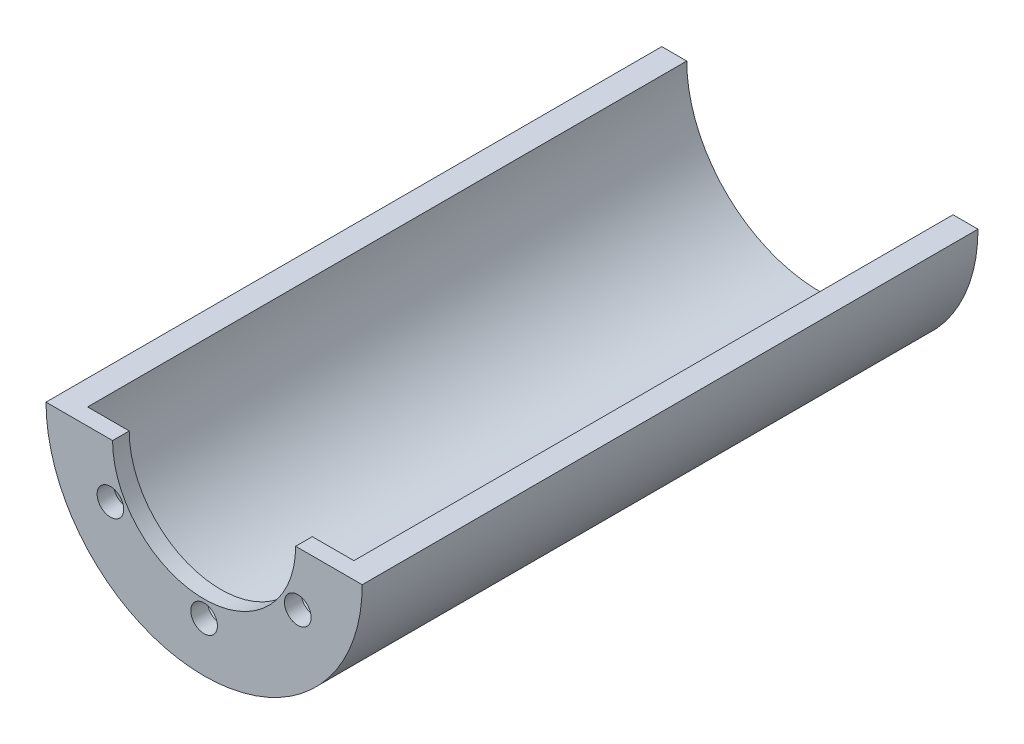
ISO-10303-21;
HEADER;
FILE_DESCRIPTION(('STEP AP214'),'2;1');
FILE_NAME('part.step','',(''),(''),'','','');
FILE_SCHEMA(('AUTOMOTIVE_DESIGN { 1 0 10303 214 1 1 1 1 }'));
ENDSEC;
DATA;
#1=APPLICATION_CONTEXT('core data for automotive mechanical design processes');
#2=APPLICATION_PROTOCOL_DEFINITION('international standard','automotive_design',2000,#1);
#3=PRODUCT_CONTEXT('',#1,'mechanical');
#4=PRODUCT('Part','Part','',(#3));
#5=PRODUCT_RELATED_PRODUCT_CATEGORY('part','',(#4));
#6=PRODUCT_DEFINITION_FORMATION('','',#4);
#7=PRODUCT_DEFINITION_CONTEXT('part definition',#1,'design');
#8=PRODUCT_DEFINITION('design','',#6,#7);
#9=PRODUCT_DEFINITION_SHAPE('','',#8);
#10=(LENGTH_UNIT() NAMED_UNIT(*) SI_UNIT(.MILLI.,.METRE.));
#11=(NAMED_UNIT(*) PLANE_ANGLE_UNIT() SI_UNIT($,.RADIAN.));
#12=(NAMED_UNIT(*) SI_UNIT($,.STERADIAN.) SOLID_ANGLE_UNIT());
#13=UNCERTAINTY_MEASURE_WITH_UNIT(LENGTH_MEASURE(1.E-05),#10,'distance_accuracy_value','');
#14=(GEOMETRIC_REPRESENTATION_CONTEXT(3) GLOBAL_UNCERTAINTY_ASSIGNED_CONTEXT((#13)) GLOBAL_UNIT_ASSIGNED_CONTEXT((#10,
#11,#12)) REPRESENTATION_CONTEXT('',''));
#15=CARTESIAN_POINT('',(0.,0.,0.));
#16=DIRECTION('',(0.,0.,1.));
#17=DIRECTION('',(1.,0.,0.));
#18=AXIS2_PLACEMENT_3D('',#15,#16,#17);
#19=CARTESIAN_POINT('',(-9.5,0.,0.));
#20=DIRECTION('',(0.,-1.,0.));
#21=DIRECTION('',(0.,0.,-1.));
#22=AXIS2_PLACEMENT_3D('',#19,#20,#21);
#23=PLANE('',#22);
#24=DIRECTION('',(-1.,0.,0.));
#25=VECTOR('',#24,1.);
#26=CARTESIAN_POINT('',(0.,0.,36.));
#27=LINE('',#26,#25);
#28=CARTESIAN_POINT('',(8.,0.,36.));
#29=VERTEX_POINT('',#28);
#30=CARTESIAN_POINT('',(5.5,0.,36.));
#31=VERTEX_POINT('',#30);
#32=EDGE_CURVE('E104',#29,#31,#27,.T.);
#33=ORIENTED_EDGE('',*,*,#32,.T.);
#34=DIRECTION('',(0.,0.,1.));
#35=VECTOR('',#34,1.);
#36=CARTESIAN_POINT('',(5.5,0.,0.));
#37=LINE('',#36,#35);
#38=CARTESIAN_POINT('',(5.5,0.,37.));
#39=VERTEX_POINT('',#38);
#40=EDGE_CURVE('E95',#31,#39,#37,.T.);
#41=ORIENTED_EDGE('',*,*,#40,.T.);
#42=DIRECTION('',(-1.,0.,0.));
#43=VECTOR('',#42,1.);
#44=CARTESIAN_POINT('',(0.,0.,37.));
#45=LINE('',#44,#43);
#46=CARTESIAN_POINT('',(9.5,0.,37.));
#47=VERTEX_POINT('',#46);
#48=EDGE_CURVE('E102',#47,#39,#45,.T.);
#49=ORIENTED_EDGE('',*,*,#48,.F.);
#50=DIRECTION('',(0.,0.,1.));
#51=VECTOR('',#50,1.);
#52=CARTESIAN_POINT('',(9.5,0.,0.));
#53=LINE('',#52,#51);
#54=CARTESIAN_POINT('',(9.5,0.,0.));
#55=VERTEX_POINT('',#54);
#56=EDGE_CURVE('E119',#55,#47,#53,.T.);
#57=ORIENTED_EDGE('',*,*,#56,.F.);
#58=DIRECTION('',(1.,0.,0.));
#59=VECTOR('',#58,1.);
#60=CARTESIAN_POINT('',(-9.5,0.,0.));
#61=LINE('',#60,#59);
#62=CARTESIAN_POINT('',(8.,0.,0.));
#63=VERTEX_POINT('',#62);
#64=EDGE_CURVE('E65',#63,#55,#61,.T.);
#65=ORIENTED_EDGE('',*,*,#64,.F.);
#66=DIRECTION('',(0.,0.,1.));
#67=VECTOR('',#66,1.);
#68=CARTESIAN_POINT('',(8.,0.,0.));
#69=LINE('',#68,#67);
#70=EDGE_CURVE('E51',#29,#63,#69,.F.);
#71=ORIENTED_EDGE('',*,*,#70,.F.);
#72=EDGE_LOOP('',(#33,#41,#49,#57,#65,#71));
#73=FACE_BOUND('',#72,.T.);
#74=ADVANCED_FACE('F43',(#73),#23,.F.);
#75=CARTESIAN_POINT('',(0.,0.,36.));
#76=DIRECTION('',(0.,0.,-1.));
#77=DIRECTION('',(-1.,0.,0.));
#78=AXIS2_PLACEMENT_3D('',#75,#76,#77);
#79=CYLINDRICAL_SURFACE('',#78,9.5);
#80=CARTESIAN_POINT('',(0.,0.,0.));
#81=DIRECTION('',(0.,0.,1.));
#82=DIRECTION('',(1.,0.,0.));
#83=AXIS2_PLACEMENT_3D('',#80,#81,#82);
#84=CIRCLE('',#83,9.5);
#85=CARTESIAN_POINT('',(-9.5,0.,0.));
#86=VERTEX_POINT('',#85);
#87=EDGE_CURVE('E127',#86,#55,#84,.T.);
#88=ORIENTED_EDGE('',*,*,#87,.T.);
#89=ORIENTED_EDGE('',*,*,#56,.T.);
#90=CARTESIAN_POINT('',(0.,0.,37.));
#91=DIRECTION('',(0.,0.,1.));
#92=DIRECTION('',(1.,0.,0.));
#93=AXIS2_PLACEMENT_3D('',#90,#91,#92);
#94=CIRCLE('',#93,9.5);
#95=CARTESIAN_POINT('',(-9.5,0.,37.));
#96=VERTEX_POINT('',#95);
#97=EDGE_CURVE('E109',#96,#47,#94,.T.);
#98=ORIENTED_EDGE('',*,*,#97,.F.);
#99=DIRECTION('',(0.,0.,1.));
#100=VECTOR('',#99,1.);
#101=CARTESIAN_POINT('',(-9.5,0.,0.));
#102=LINE('',#101,#100);
#103=EDGE_CURVE('E118',#86,#96,#102,.T.);
#104=ORIENTED_EDGE('',*,*,#103,.F.);
#105=EDGE_LOOP('',(#88,#89,#98,#104));
#106=FACE_BOUND('',#105,.T.);
#107=ADVANCED_FACE('F45',(#106),#79,.T.);
#108=CARTESIAN_POINT('',(0.,0.,0.));
#109=DIRECTION('',(0.,0.,1.));
#110=DIRECTION('',(1.,0.,0.));
#111=AXIS2_PLACEMENT_3D('',#108,#109,#110);
#112=PLANE('',#111);
#113=ORIENTED_EDGE('',*,*,#87,.F.);
#114=CARTESIAN_POINT('',(-8.,0.,0.));
#115=VERTEX_POINT('',#114);
#116=EDGE_CURVE('E112',#86,#115,#61,.T.);
#117=ORIENTED_EDGE('',*,*,#116,.T.);
#118=CARTESIAN_POINT('',(0.,0.,0.));
#119=DIRECTION('',(0.,0.,1.));
#120=DIRECTION('',(1.,0.,0.));
#121=AXIS2_PLACEMENT_3D('',#118,#119,#120);
#122=CIRCLE('',#121,8.);
#123=EDGE_CURVE('E124',#115,#63,#122,.T.);
#124=ORIENTED_EDGE('',*,*,#123,.T.);
#125=ORIENTED_EDGE('',*,*,#64,.T.);
#126=EDGE_LOOP('',(#113,#117,#124,#125));
#127=FACE_BOUND('',#126,.T.);
#128=ADVANCED_FACE('F140',(#127),#112,.F.);
#129=CARTESIAN_POINT('',(0.,0.,0.));
#130=DIRECTION('',(0.,0.,1.));
#131=DIRECTION('',(1.,0.,0.));
#132=AXIS2_PLACEMENT_3D('',#129,#130,#131);
#133=CYLINDRICAL_SURFACE('',#132,8.);
#134=CARTESIAN_POINT('',(0.,0.,36.));
#135=DIRECTION('',(0.,0.,1.));
#136=DIRECTION('',(1.,0.,0.));
#137=AXIS2_PLACEMENT_3D('',#134,#135,#136);
#138=CIRCLE('',#137,8.);
#139=CARTESIAN_POINT('',(-8.,0.,36.));
#140=VERTEX_POINT('',#139);
#141=EDGE_CURVE('E121',#140,#29,#138,.T.);
#142=ORIENTED_EDGE('',*,*,#141,.T.);
#143=ORIENTED_EDGE('',*,*,#70,.T.);
#144=ORIENTED_EDGE('',*,*,#123,.F.);
#145=DIRECTION('',(0.,0.,1.));
#146=VECTOR('',#145,1.);
#147=CARTESIAN_POINT('',(-8.,0.,0.));
#148=LINE('',#147,#146);
#149=EDGE_CURVE('E132',#115,#140,#148,.T.);
#150=ORIENTED_EDGE('',*,*,#149,.T.);
#151=EDGE_LOOP('',(#142,#143,#144,#150));
#152=FACE_BOUND('',#151,.T.);
#153=ADVANCED_FACE('F136',(#152),#133,.F.);
#154=CARTESIAN_POINT('',(-5.5,0.,37.));
#155=VERTEX_POINT('',#154);
#156=EDGE_CURVE('E110',#155,#96,#45,.T.);
#157=ORIENTED_EDGE('',*,*,#156,.F.);
#158=DIRECTION('',(0.,0.,1.));
#159=VECTOR('',#158,1.);
#160=CARTESIAN_POINT('',(-5.5,0.,0.));
#161=LINE('',#160,#159);
#162=CARTESIAN_POINT('',(-5.5,0.,36.));
#163=VERTEX_POINT('',#162);
#164=EDGE_CURVE('E57',#155,#163,#161,.F.);
#165=ORIENTED_EDGE('',*,*,#164,.T.);
#166=EDGE_CURVE('E105',#163,#140,#27,.T.);
#167=ORIENTED_EDGE('',*,*,#166,.T.);
#168=ORIENTED_EDGE('',*,*,#149,.F.);
#169=ORIENTED_EDGE('',*,*,#116,.F.);
#170=ORIENTED_EDGE('',*,*,#103,.T.);
#171=EDGE_LOOP('',(#157,#165,#167,#168,#169,#170));
#172=FACE_BOUND('',#171,.T.);
#173=ADVANCED_FACE('F143',(#172),#23,.F.);
#174=CARTESIAN_POINT('',(0.,0.,36.));
#175=DIRECTION('',(0.,0.,1.));
#176=DIRECTION('',(1.,0.,0.));
#177=AXIS2_PLACEMENT_3D('',#174,#175,#176);
#178=PLANE('',#177);
#179=CARTESIAN_POINT('',(-5.62916512459881,-3.25000000000007,36.));
#180=DIRECTION('',(0.,0.,-1.));
#181=DIRECTION('',(-0.50000000000001,0.866025403784433,0.));
#182=AXIS2_PLACEMENT_3D('',#179,#180,#181);
#183=CIRCLE('',#182,0.8);
#184=CARTESIAN_POINT('',(-6.02916512459882,-2.55717967697252,36.));
#185=VERTEX_POINT('',#184);
#186=EDGE_CURVE('E276',#185,#185,#183,.T.);
#187=ORIENTED_EDGE('',*,*,#186,.F.);
#188=EDGE_LOOP('',(#187));
#189=FACE_BOUND('',#188,.T.);
#190=CARTESIAN_POINT('',(5.62916512459886,-3.24999999999999,36.));
#191=DIRECTION('',(0.,0.,-1.));
#192=DIRECTION('',(-0.499999999999998,-0.86602540378444,0.));
#193=AXIS2_PLACEMENT_3D('',#190,#191,#192);
#194=CIRCLE('',#193,0.8);
#195=CARTESIAN_POINT('',(5.22916512459886,-3.94282032302754,36.));
#196=VERTEX_POINT('',#195);
#197=EDGE_CURVE('E278',#196,#196,#194,.T.);
#198=ORIENTED_EDGE('',*,*,#197,.F.);
#199=EDGE_LOOP('',(#198));
#200=FACE_BOUND('',#199,.T.);
#201=CARTESIAN_POINT('',(0.,-6.5,36.));
#202=DIRECTION('',(0.,0.,-1.));
#203=DIRECTION('',(-1.,0.,0.));
#204=AXIS2_PLACEMENT_3D('',#201,#202,#203);
#205=CIRCLE('',#204,0.8);
#206=CARTESIAN_POINT('',(-0.8,-6.5,36.));
#207=VERTEX_POINT('',#206);
#208=EDGE_CURVE('E284',#207,#207,#205,.T.);
#209=ORIENTED_EDGE('',*,*,#208,.F.);
#210=EDGE_LOOP('',(#209));
#211=FACE_BOUND('',#210,.T.);
#212=ORIENTED_EDGE('',*,*,#166,.F.);
#213=CARTESIAN_POINT('',(0.,0.,36.));
#214=DIRECTION('',(0.,0.,1.));
#215=DIRECTION('',(1.,0.,0.));
#216=AXIS2_PLACEMENT_3D('',#213,#214,#215);
#217=CIRCLE('',#216,5.5);
#218=EDGE_CURVE('E290',#163,#31,#217,.T.);
#219=ORIENTED_EDGE('',*,*,#218,.T.);
#220=ORIENTED_EDGE('',*,*,#32,.F.);
#221=ORIENTED_EDGE('',*,*,#141,.F.);
#222=EDGE_LOOP('',(#212,#219,#220,#221));
#223=FACE_BOUND('',#222,.T.);
#224=ADVANCED_FACE('F156',(#189,#200,#211,#223),#178,.F.);
#225=CARTESIAN_POINT('',(0.,0.,37.));
#226=DIRECTION('',(0.,0.,1.));
#227=DIRECTION('',(1.,0.,0.));
#228=AXIS2_PLACEMENT_3D('',#225,#226,#227);
#229=PLANE('',#228);
#230=CARTESIAN_POINT('',(-5.62916512459881,-3.25000000000007,37.));
#231=DIRECTION('',(0.,0.,-1.));
#232=DIRECTION('',(-0.50000000000001,0.866025403784433,0.));
#233=AXIS2_PLACEMENT_3D('',#230,#231,#232);
#234=CIRCLE('',#233,0.8);
#235=CARTESIAN_POINT('',(-6.02916512459882,-2.55717967697252,37.));
#236=VERTEX_POINT('',#235);
#237=EDGE_CURVE('E273',#236,#236,#234,.T.);
#238=ORIENTED_EDGE('',*,*,#237,.T.);
#239=EDGE_LOOP('',(#238));
#240=FACE_BOUND('',#239,.T.);
#241=CARTESIAN_POINT('',(5.62916512459886,-3.24999999999999,37.));
#242=DIRECTION('',(0.,0.,-1.));
#243=DIRECTION('',(-0.499999999999998,-0.86602540378444,0.));
#244=AXIS2_PLACEMENT_3D('',#241,#242,#243);
#245=CIRCLE('',#244,0.8);
#246=CARTESIAN_POINT('',(5.22916512459886,-3.94282032302754,37.));
#247=VERTEX_POINT('',#246);
#248=EDGE_CURVE('E281',#247,#247,#245,.T.);
#249=ORIENTED_EDGE('',*,*,#248,.T.);
#250=EDGE_LOOP('',(#249));
#251=FACE_BOUND('',#250,.T.);
#252=CARTESIAN_POINT('',(0.,-6.5,37.));
#253=DIRECTION('',(0.,0.,-1.));
#254=DIRECTION('',(-1.,0.,0.));
#255=AXIS2_PLACEMENT_3D('',#252,#253,#254);
#256=CIRCLE('',#255,0.8);
#257=CARTESIAN_POINT('',(-0.8,-6.5,37.));
#258=VERTEX_POINT('',#257);
#259=EDGE_CURVE('E287',#258,#258,#256,.T.);
#260=ORIENTED_EDGE('',*,*,#259,.T.);
#261=EDGE_LOOP('',(#260));
#262=FACE_BOUND('',#261,.T.);
#263=CARTESIAN_POINT('',(0.,0.,37.));
#264=DIRECTION('',(0.,0.,1.));
#265=DIRECTION('',(1.,0.,0.));
#266=AXIS2_PLACEMENT_3D('',#263,#264,#265);
#267=CIRCLE('',#266,5.5);
#268=EDGE_CURVE('E11',#155,#39,#267,.T.);
#269=ORIENTED_EDGE('',*,*,#268,.F.);
#270=ORIENTED_EDGE('',*,*,#156,.T.);
#271=ORIENTED_EDGE('',*,*,#97,.T.);
#272=ORIENTED_EDGE('',*,*,#48,.T.);
#273=EDGE_LOOP('',(#269,#270,#271,#272));
#274=FACE_BOUND('',#273,.T.);
#275=ADVANCED_FACE('F107',(#240,#251,#262,#274),#229,.T.);
#276=CARTESIAN_POINT('',(0.,0.,0.));
#277=DIRECTION('',(0.,0.,1.));
#278=DIRECTION('',(1.,0.,0.));
#279=AXIS2_PLACEMENT_3D('',#276,#277,#278);
#280=CYLINDRICAL_SURFACE('',#279,5.5);
#281=ORIENTED_EDGE('',*,*,#218,.F.);
#282=ORIENTED_EDGE('',*,*,#164,.F.);
#283=ORIENTED_EDGE('',*,*,#268,.T.);
#284=ORIENTED_EDGE('',*,*,#40,.F.);
#285=EDGE_LOOP('',(#281,#282,#283,#284));
#286=FACE_BOUND('',#285,.T.);
#287=ADVANCED_FACE('F94',(#286),#280,.F.);
#288=CARTESIAN_POINT('',(0.,-6.5,37.));
#289=DIRECTION('',(0.,0.,-1.));
#290=DIRECTION('',(-1.,0.,0.));
#291=AXIS2_PLACEMENT_3D('',#288,#289,#290);
#292=CYLINDRICAL_SURFACE('',#291,0.8);
#293=ORIENTED_EDGE('',*,*,#259,.F.);
#294=EDGE_LOOP('',(#293));
#295=FACE_BOUND('',#294,.T.);
#296=ORIENTED_EDGE('',*,*,#208,.T.);
#297=EDGE_LOOP('',(#296));
#298=FACE_BOUND('',#297,.T.);
#299=ADVANCED_FACE('F238',(#295,#298),#292,.F.);
#300=CARTESIAN_POINT('',(5.62916512459886,-3.24999999999999,37.));
#301=DIRECTION('',(0.,0.,-1.));
#302=DIRECTION('',(-1.,0.,0.));
#303=AXIS2_PLACEMENT_3D('',#300,#301,#302);
#304=CYLINDRICAL_SURFACE('',#303,0.8);
#305=ORIENTED_EDGE('',*,*,#248,.F.);
#306=EDGE_LOOP('',(#305));
#307=FACE_BOUND('',#306,.T.);
#308=ORIENTED_EDGE('',*,*,#197,.T.);
#309=EDGE_LOOP('',(#308));
#310=FACE_BOUND('',#309,.T.);
#311=ADVANCED_FACE('F245',(#307,#310),#304,.F.);
#312=CARTESIAN_POINT('',(-5.62916512459881,-3.25000000000007,37.));
#313=DIRECTION('',(0.,0.,-1.));
#314=DIRECTION('',(-1.,0.,0.));
#315=AXIS2_PLACEMENT_3D('',#312,#313,#314);
#316=CYLINDRICAL_SURFACE('',#315,0.8);
#317=ORIENTED_EDGE('',*,*,#237,.F.);
#318=EDGE_LOOP('',(#317));
#319=FACE_BOUND('',#318,.T.);
#320=ORIENTED_EDGE('',*,*,#186,.T.);
#321=EDGE_LOOP('',(#320));
#322=FACE_BOUND('',#321,.T.);
#323=ADVANCED_FACE('F253',(#319,#322),#316,.F.);
#324=CLOSED_SHELL('',(#74,#107,#128,#153,#173,#224,#275,#287,#299,#311,#323));
#325=MANIFOLD_SOLID_BREP('B2',#324);
#326=ADVANCED_BREP_SHAPE_REPRESENTATION('',(#18,#325),#14);
#327=SHAPE_DEFINITION_REPRESENTATION(#9,#326);
ENDSEC;
END-ISO-10303-21;
